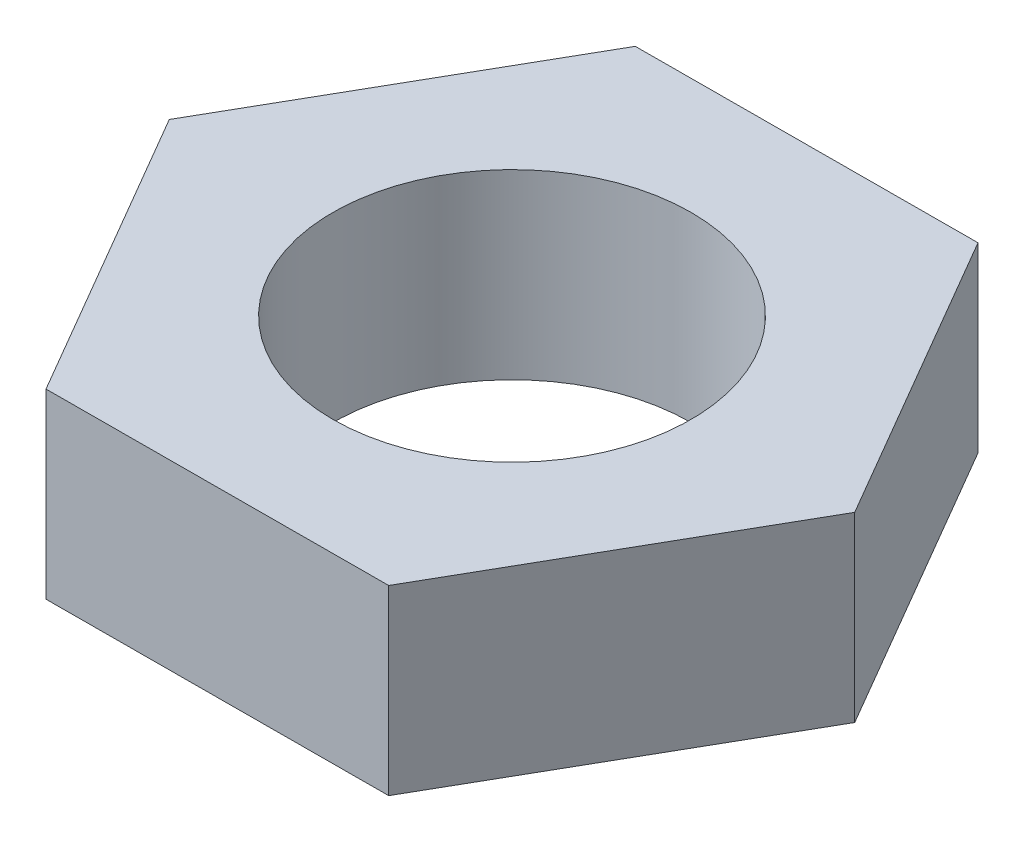
ISO-10303-21;
HEADER;
FILE_DESCRIPTION(('STEP AP214'),'2;1');
FILE_NAME('part.step','',(''),(''),'','','');
FILE_SCHEMA(('AUTOMOTIVE_DESIGN { 1 0 10303 214 1 1 1 1 }'));
ENDSEC;
DATA;
#1=APPLICATION_CONTEXT('core data for automotive mechanical design processes');
#2=APPLICATION_PROTOCOL_DEFINITION('international standard','automotive_design',2000,#1);
#3=PRODUCT_CONTEXT('',#1,'mechanical');
#4=PRODUCT('Part','Part','',(#3));
#5=PRODUCT_RELATED_PRODUCT_CATEGORY('part','',(#4));
#6=PRODUCT_DEFINITION_FORMATION('','',#4);
#7=PRODUCT_DEFINITION_CONTEXT('part definition',#1,'design');
#8=PRODUCT_DEFINITION('design','',#6,#7);
#9=PRODUCT_DEFINITION_SHAPE('','',#8);
#10=(LENGTH_UNIT() NAMED_UNIT(*) SI_UNIT(.MILLI.,.METRE.));
#11=(NAMED_UNIT(*) PLANE_ANGLE_UNIT() SI_UNIT($,.RADIAN.));
#12=(NAMED_UNIT(*) SI_UNIT($,.STERADIAN.) SOLID_ANGLE_UNIT());
#13=UNCERTAINTY_MEASURE_WITH_UNIT(LENGTH_MEASURE(1.E-05),#10,'distance_accuracy_value','');
#14=(GEOMETRIC_REPRESENTATION_CONTEXT(3) GLOBAL_UNCERTAINTY_ASSIGNED_CONTEXT((#13)) GLOBAL_UNIT_ASSIGNED_CONTEXT((#10,
#11,#12)) REPRESENTATION_CONTEXT('',''));
#15=CARTESIAN_POINT('',(0.,0.,0.));
#16=DIRECTION('',(0.,0.,1.));
#17=DIRECTION('',(1.,0.,0.));
#18=AXIS2_PLACEMENT_3D('',#15,#16,#17);
#19=CARTESIAN_POINT('',(15.48581609446,8.255,-0.0566904627170724));
#20=DIRECTION('',(-0.864189213523948,0.,0.503166973507662));
#21=DIRECTION('',(0.503166973507662,0.,0.864189213523948));
#22=AXIS2_PLACEMENT_3D('',#19,#20,#21);
#23=PLANE('',#22);
#24=DIRECTION('',(-0.503166973507662,0.,-0.864189213523948));
#25=VECTOR('',#24,1.);
#26=CARTESIAN_POINT('',(15.48581609446,0.,-0.0566904627170724));
#27=LINE('',#26,#25);
#28=CARTESIAN_POINT('',(15.48581609446,0.,-0.0566904627170724));
#29=VERTEX_POINT('',#28);
#30=CARTESIAN_POINT('',(7.69381266636473,0.,-13.4394553674948));
#31=VERTEX_POINT('',#30);
#32=EDGE_CURVE('E132',#29,#31,#27,.T.);
#33=ORIENTED_EDGE('',*,*,#32,.T.);
#34=DIRECTION('',(0.,-1.,0.));
#35=VECTOR('',#34,1.);
#36=CARTESIAN_POINT('',(7.69381266636473,8.255,-13.4394553674948));
#37=LINE('',#36,#35);
#38=CARTESIAN_POINT('',(7.69381266636473,8.255,-13.4394553674948));
#39=VERTEX_POINT('',#38);
#40=EDGE_CURVE('E11',#39,#31,#37,.T.);
#41=ORIENTED_EDGE('',*,*,#40,.F.);
#42=DIRECTION('',(-0.503166973507662,0.,-0.864189213523948));
#43=VECTOR('',#42,1.);
#44=CARTESIAN_POINT('',(15.48581609446,8.255,-0.0566904627170724));
#45=LINE('',#44,#43);
#46=CARTESIAN_POINT('',(15.48581609446,8.255,-0.0566904627170724));
#47=VERTEX_POINT('',#46);
#48=EDGE_CURVE('E149',#47,#39,#45,.T.);
#49=ORIENTED_EDGE('',*,*,#48,.F.);
#50=DIRECTION('',(0.,-1.,0.));
#51=VECTOR('',#50,1.);
#52=CARTESIAN_POINT('',(15.48581609446,8.255,-0.0566904627170724));
#53=LINE('',#52,#51);
#54=EDGE_CURVE('E128',#47,#29,#53,.T.);
#55=ORIENTED_EDGE('',*,*,#54,.T.);
#56=EDGE_LOOP('',(#33,#41,#49,#55));
#57=FACE_BOUND('',#56,.T.);
#58=ADVANCED_FACE('F43',(#57),#23,.F.);
#59=CARTESIAN_POINT('',(7.69381266636473,8.255,-13.4394553674948));
#60=DIRECTION('',(0.00366077464099213,0.,0.999993299342065));
#61=DIRECTION('',(0.999993299342065,0.,-0.00366077464099213));
#62=AXIS2_PLACEMENT_3D('',#59,#60,#61);
#63=PLANE('',#62);
#64=DIRECTION('',(-0.999993299342064,0.,0.00366077464099213));
#65=VECTOR('',#64,1.);
#66=CARTESIAN_POINT('',(7.69381266636473,0.,-13.4394553674948));
#67=LINE('',#66,#65);
#68=CARTESIAN_POINT('',(-7.79200342809529,0.,-13.3827649047778));
#69=VERTEX_POINT('',#68);
#70=EDGE_CURVE('E136',#31,#69,#67,.T.);
#71=ORIENTED_EDGE('',*,*,#70,.T.);
#72=DIRECTION('',(0.,-1.,0.));
#73=VECTOR('',#72,1.);
#74=CARTESIAN_POINT('',(-7.79200342809529,8.255,-13.3827649047778));
#75=LINE('',#74,#73);
#76=CARTESIAN_POINT('',(-7.79200342809529,8.255,-13.3827649047778));
#77=VERTEX_POINT('',#76);
#78=EDGE_CURVE('E52',#77,#69,#75,.T.);
#79=ORIENTED_EDGE('',*,*,#78,.F.);
#80=DIRECTION('',(-0.999993299342064,0.,0.00366077464099213));
#81=VECTOR('',#80,1.);
#82=CARTESIAN_POINT('',(7.69381266636473,8.255,-13.4394553674948));
#83=LINE('',#82,#81);
#84=EDGE_CURVE('E97',#39,#77,#83,.T.);
#85=ORIENTED_EDGE('',*,*,#84,.F.);
#86=ORIENTED_EDGE('',*,*,#40,.T.);
#87=EDGE_LOOP('',(#71,#79,#85,#86));
#88=FACE_BOUND('',#87,.T.);
#89=ADVANCED_FACE('F178',(#88),#63,.F.);
#90=CARTESIAN_POINT('',(-7.79200342809529,8.255,-13.3827649047778));
#91=DIRECTION('',(0.867849988164941,0.,0.496826325834403));
#92=DIRECTION('',(0.496826325834403,0.,-0.867849988164941));
#93=AXIS2_PLACEMENT_3D('',#90,#91,#92);
#94=PLANE('',#93);
#95=DIRECTION('',(-0.496826325834403,0.,0.867849988164941));
#96=VECTOR('',#95,1.);
#97=CARTESIAN_POINT('',(-7.79200342809529,0.,-13.3827649047778));
#98=LINE('',#97,#96);
#99=CARTESIAN_POINT('',(-15.48581609446,0.,0.0566904627170724));
#100=VERTEX_POINT('',#99);
#101=EDGE_CURVE('E140',#69,#100,#98,.T.);
#102=ORIENTED_EDGE('',*,*,#101,.T.);
#103=DIRECTION('',(0.,-1.,0.));
#104=VECTOR('',#103,1.);
#105=CARTESIAN_POINT('',(-15.48581609446,8.255,0.0566904627170724));
#106=LINE('',#105,#104);
#107=CARTESIAN_POINT('',(-15.48581609446,8.255,0.0566904627170724));
#108=VERTEX_POINT('',#107);
#109=EDGE_CURVE('E121',#108,#100,#106,.T.);
#110=ORIENTED_EDGE('',*,*,#109,.F.);
#111=DIRECTION('',(-0.496826325834403,0.,0.867849988164941));
#112=VECTOR('',#111,1.);
#113=CARTESIAN_POINT('',(-7.79200342809529,8.255,-13.3827649047778));
#114=LINE('',#113,#112);
#115=EDGE_CURVE('E110',#77,#108,#114,.T.);
#116=ORIENTED_EDGE('',*,*,#115,.F.);
#117=ORIENTED_EDGE('',*,*,#78,.T.);
#118=EDGE_LOOP('',(#102,#110,#116,#117));
#119=FACE_BOUND('',#118,.T.);
#120=ADVANCED_FACE('F159',(#119),#94,.F.);
#121=CARTESIAN_POINT('',(-15.48581609446,8.255,0.0566904627170724));
#122=DIRECTION('',(0.864189213523948,0.,-0.503166973507662));
#123=DIRECTION('',(-0.503166973507662,0.,-0.864189213523948));
#124=AXIS2_PLACEMENT_3D('',#121,#122,#123);
#125=PLANE('',#124);
#126=DIRECTION('',(0.503166973507662,0.,0.864189213523948));
#127=VECTOR('',#126,1.);
#128=CARTESIAN_POINT('',(-15.48581609446,0.,0.0566904627170724));
#129=LINE('',#128,#127);
#130=CARTESIAN_POINT('',(-7.69381266636472,0.,13.4394553674948));
#131=VERTEX_POINT('',#130);
#132=EDGE_CURVE('E119',#100,#131,#129,.T.);
#133=ORIENTED_EDGE('',*,*,#132,.T.);
#134=DIRECTION('',(0.,-1.,0.));
#135=VECTOR('',#134,1.);
#136=CARTESIAN_POINT('',(-7.69381266636472,8.255,13.4394553674948));
#137=LINE('',#136,#135);
#138=CARTESIAN_POINT('',(-7.69381266636472,8.255,13.4394553674948));
#139=VERTEX_POINT('',#138);
#140=EDGE_CURVE('E116',#139,#131,#137,.T.);
#141=ORIENTED_EDGE('',*,*,#140,.F.);
#142=DIRECTION('',(0.503166973507662,0.,0.864189213523948));
#143=VECTOR('',#142,1.);
#144=CARTESIAN_POINT('',(-15.48581609446,8.255,0.0566904627170724));
#145=LINE('',#144,#143);
#146=EDGE_CURVE('E104',#108,#139,#145,.T.);
#147=ORIENTED_EDGE('',*,*,#146,.F.);
#148=ORIENTED_EDGE('',*,*,#109,.T.);
#149=EDGE_LOOP('',(#133,#141,#147,#148));
#150=FACE_BOUND('',#149,.T.);
#151=ADVANCED_FACE('F117',(#150),#125,.F.);
#152=CARTESIAN_POINT('',(-7.69381266636472,8.255,13.4394553674948));
#153=DIRECTION('',(-0.00366077464099191,0.,-0.999993299342065));
#154=DIRECTION('',(-0.999993299342065,0.,0.00366077464099191));
#155=AXIS2_PLACEMENT_3D('',#152,#153,#154);
#156=PLANE('',#155);
#157=DIRECTION('',(0.999993299342065,0.,-0.00366077464099191));
#158=VECTOR('',#157,1.);
#159=CARTESIAN_POINT('',(-7.69381266636472,0.,13.4394553674948));
#160=LINE('',#159,#158);
#161=CARTESIAN_POINT('',(7.79200342809529,0.,13.3827649047778));
#162=VERTEX_POINT('',#161);
#163=EDGE_CURVE('E83',#131,#162,#160,.T.);
#164=ORIENTED_EDGE('',*,*,#163,.T.);
#165=DIRECTION('',(0.,-1.,0.));
#166=VECTOR('',#165,1.);
#167=CARTESIAN_POINT('',(7.79200342809529,8.255,13.3827649047778));
#168=LINE('',#167,#166);
#169=CARTESIAN_POINT('',(7.79200342809529,8.255,13.3827649047778));
#170=VERTEX_POINT('',#169);
#171=EDGE_CURVE('E122',#170,#162,#168,.T.);
#172=ORIENTED_EDGE('',*,*,#171,.F.);
#173=DIRECTION('',(0.999993299342065,0.,-0.00366077464099191));
#174=VECTOR('',#173,1.);
#175=CARTESIAN_POINT('',(-7.69381266636472,8.255,13.4394553674948));
#176=LINE('',#175,#174);
#177=EDGE_CURVE('E108',#139,#170,#176,.T.);
#178=ORIENTED_EDGE('',*,*,#177,.F.);
#179=ORIENTED_EDGE('',*,*,#140,.T.);
#180=EDGE_LOOP('',(#164,#172,#178,#179));
#181=FACE_BOUND('',#180,.T.);
#182=ADVANCED_FACE('F124',(#181),#156,.F.);
#183=CARTESIAN_POINT('',(7.79200342809529,8.255,13.3827649047778));
#184=DIRECTION('',(-0.867849988164941,0.,-0.496826325834403));
#185=DIRECTION('',(-0.496826325834403,0.,0.867849988164941));
#186=AXIS2_PLACEMENT_3D('',#183,#184,#185);
#187=PLANE('',#186);
#188=DIRECTION('',(0.496826325834403,0.,-0.867849988164941));
#189=VECTOR('',#188,1.);
#190=CARTESIAN_POINT('',(7.79200342809529,0.,13.3827649047778));
#191=LINE('',#190,#189);
#192=EDGE_CURVE('E89',#162,#29,#191,.T.);
#193=ORIENTED_EDGE('',*,*,#192,.T.);
#194=ORIENTED_EDGE('',*,*,#54,.F.);
#195=DIRECTION('',(0.496826325834403,0.,-0.867849988164941));
#196=VECTOR('',#195,1.);
#197=CARTESIAN_POINT('',(7.79200342809529,8.255,13.3827649047778));
#198=LINE('',#197,#196);
#199=EDGE_CURVE('E60',#170,#47,#198,.T.);
#200=ORIENTED_EDGE('',*,*,#199,.F.);
#201=ORIENTED_EDGE('',*,*,#171,.T.);
#202=EDGE_LOOP('',(#193,#194,#200,#201));
#203=FACE_BOUND('',#202,.T.);
#204=ADVANCED_FACE('F166',(#203),#187,.F.);
#205=CARTESIAN_POINT('',(0.,8.255,0.));
#206=DIRECTION('',(0.,1.,0.));
#207=DIRECTION('',(0.,0.,1.));
#208=AXIS2_PLACEMENT_3D('',#205,#206,#207);
#209=PLANE('',#208);
#210=CARTESIAN_POINT('',(0.,8.255,0.));
#211=DIRECTION('',(0.,1.,0.));
#212=DIRECTION('',(0.,0.,1.));
#213=AXIS2_PLACEMENT_3D('',#210,#211,#212);
#214=CIRCLE('',#213,8.128);
#215=CARTESIAN_POINT('',(0.,8.255,8.128));
#216=VERTEX_POINT('',#215);
#217=EDGE_CURVE('E265',#216,#216,#214,.T.);
#218=ORIENTED_EDGE('',*,*,#217,.F.);
#219=EDGE_LOOP('',(#218));
#220=FACE_BOUND('',#219,.T.);
#221=ORIENTED_EDGE('',*,*,#48,.T.);
#222=ORIENTED_EDGE('',*,*,#84,.T.);
#223=ORIENTED_EDGE('',*,*,#115,.T.);
#224=ORIENTED_EDGE('',*,*,#146,.T.);
#225=ORIENTED_EDGE('',*,*,#177,.T.);
#226=ORIENTED_EDGE('',*,*,#199,.T.);
#227=EDGE_LOOP('',(#221,#222,#223,#224,#225,#226));
#228=FACE_BOUND('',#227,.T.);
#229=ADVANCED_FACE('F106',(#220,#228),#209,.T.);
#230=CARTESIAN_POINT('',(0.,0.,0.));
#231=DIRECTION('',(0.,1.,0.));
#232=DIRECTION('',(0.,0.,1.));
#233=AXIS2_PLACEMENT_3D('',#230,#231,#232);
#234=PLANE('',#233);
#235=CARTESIAN_POINT('',(0.,0.,0.));
#236=DIRECTION('',(0.,1.,0.));
#237=DIRECTION('',(0.,0.,1.));
#238=AXIS2_PLACEMENT_3D('',#235,#236,#237);
#239=CIRCLE('',#238,8.128);
#240=CARTESIAN_POINT('',(0.,0.,8.128));
#241=VERTEX_POINT('',#240);
#242=EDGE_CURVE('E137',#241,#241,#239,.T.);
#243=ORIENTED_EDGE('',*,*,#242,.T.);
#244=EDGE_LOOP('',(#243));
#245=FACE_BOUND('',#244,.T.);
#246=ORIENTED_EDGE('',*,*,#32,.F.);
#247=ORIENTED_EDGE('',*,*,#192,.F.);
#248=ORIENTED_EDGE('',*,*,#163,.F.);
#249=ORIENTED_EDGE('',*,*,#132,.F.);
#250=ORIENTED_EDGE('',*,*,#101,.F.);
#251=ORIENTED_EDGE('',*,*,#70,.F.);
#252=EDGE_LOOP('',(#246,#247,#248,#249,#250,#251));
#253=FACE_BOUND('',#252,.T.);
#254=ADVANCED_FACE('F162',(#245,#253),#234,.F.);
#255=CARTESIAN_POINT('',(0.,0.,0.));
#256=DIRECTION('',(0.,1.,0.));
#257=DIRECTION('',(0.,0.,1.));
#258=AXIS2_PLACEMENT_3D('',#255,#256,#257);
#259=CYLINDRICAL_SURFACE('',#258,8.128);
#260=ORIENTED_EDGE('',*,*,#242,.F.);
#261=EDGE_LOOP('',(#260));
#262=FACE_BOUND('',#261,.T.);
#263=ORIENTED_EDGE('',*,*,#217,.T.);
#264=EDGE_LOOP('',(#263));
#265=FACE_BOUND('',#264,.T.);
#266=ADVANCED_FACE('F218',(#262,#265),#259,.F.);
#267=CLOSED_SHELL('',(#58,#89,#120,#151,#182,#204,#229,#254,#266));
#268=MANIFOLD_SOLID_BREP('B2',#267);
#269=ADVANCED_BREP_SHAPE_REPRESENTATION('',(#18,#268),#14);
#270=SHAPE_DEFINITION_REPRESENTATION(#9,#269);
ENDSEC;
END-ISO-10303-21;
